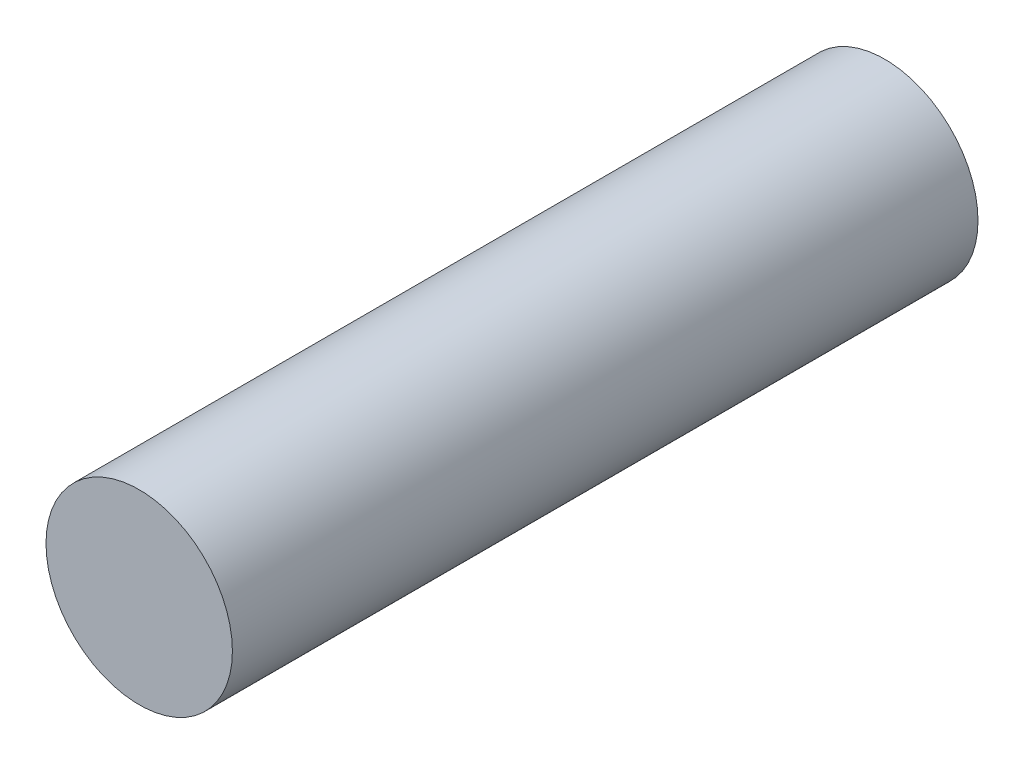
ISO-10303-21;
HEADER;
FILE_DESCRIPTION(('STEP AP214'),'2;1');
FILE_NAME('part.step','',(''),(''),'','','');
FILE_SCHEMA(('AUTOMOTIVE_DESIGN { 1 0 10303 214 1 1 1 1 }'));
ENDSEC;
DATA;
#1=APPLICATION_CONTEXT('core data for automotive mechanical design processes');
#2=APPLICATION_PROTOCOL_DEFINITION('international standard','automotive_design',2000,#1);
#3=PRODUCT_CONTEXT('',#1,'mechanical');
#4=PRODUCT('Part','Part','',(#3));
#5=PRODUCT_RELATED_PRODUCT_CATEGORY('part','',(#4));
#6=PRODUCT_DEFINITION_FORMATION('','',#4);
#7=PRODUCT_DEFINITION_CONTEXT('part definition',#1,'design');
#8=PRODUCT_DEFINITION('design','',#6,#7);
#9=PRODUCT_DEFINITION_SHAPE('','',#8);
#10=(LENGTH_UNIT() NAMED_UNIT(*) SI_UNIT(.MILLI.,.METRE.));
#11=(NAMED_UNIT(*) PLANE_ANGLE_UNIT() SI_UNIT($,.RADIAN.));
#12=(NAMED_UNIT(*) SI_UNIT($,.STERADIAN.) SOLID_ANGLE_UNIT());
#13=UNCERTAINTY_MEASURE_WITH_UNIT(LENGTH_MEASURE(1.E-05),#10,'distance_accuracy_value','');
#14=(GEOMETRIC_REPRESENTATION_CONTEXT(3) GLOBAL_UNCERTAINTY_ASSIGNED_CONTEXT((#13)) GLOBAL_UNIT_ASSIGNED_CONTEXT((#10,
#11,#12)) REPRESENTATION_CONTEXT('',''));
#15=CARTESIAN_POINT('',(0.,0.,0.));
#16=DIRECTION('',(0.,0.,1.));
#17=DIRECTION('',(1.,0.,0.));
#18=AXIS2_PLACEMENT_3D('',#15,#16,#17);
#19=CARTESIAN_POINT('',(0.,0.,84.));
#20=DIRECTION('',(0.,0.,-1.));
#21=DIRECTION('',(-1.,0.,0.));
#22=AXIS2_PLACEMENT_3D('',#19,#20,#21);
#23=CYLINDRICAL_SURFACE('',#22,10.5);
#24=CARTESIAN_POINT('',(0.,0.,84.));
#25=DIRECTION('',(0.,0.,1.));
#26=DIRECTION('',(1.,0.,0.));
#27=AXIS2_PLACEMENT_3D('',#24,#25,#26);
#28=CIRCLE('',#27,10.5);
#29=CARTESIAN_POINT('',(10.5,0.,84.));
#30=VERTEX_POINT('',#29);
#31=EDGE_CURVE('E10',#30,#30,#28,.T.);
#32=ORIENTED_EDGE('',*,*,#31,.F.);
#33=EDGE_LOOP('',(#32));
#34=FACE_BOUND('',#33,.T.);
#35=CARTESIAN_POINT('',(0.,0.,0.));
#36=DIRECTION('',(0.,0.,1.));
#37=DIRECTION('',(1.,0.,0.));
#38=AXIS2_PLACEMENT_3D('',#35,#36,#37);
#39=CIRCLE('',#38,10.5);
#40=CARTESIAN_POINT('',(10.5,0.,0.));
#41=VERTEX_POINT('',#40);
#42=EDGE_CURVE('E42',#41,#41,#39,.T.);
#43=ORIENTED_EDGE('',*,*,#42,.T.);
#44=EDGE_LOOP('',(#43));
#45=FACE_BOUND('',#44,.T.);
#46=ADVANCED_FACE('F39',(#34,#45),#23,.T.);
#47=CARTESIAN_POINT('',(0.,0.,84.));
#48=DIRECTION('',(0.,0.,1.));
#49=DIRECTION('',(1.,0.,0.));
#50=AXIS2_PLACEMENT_3D('',#47,#48,#49);
#51=PLANE('',#50);
#52=ORIENTED_EDGE('',*,*,#31,.T.);
#53=EDGE_LOOP('',(#52));
#54=FACE_BOUND('',#53,.T.);
#55=ADVANCED_FACE('F56',(#54),#51,.T.);
#56=CARTESIAN_POINT('',(0.,0.,0.));
#57=DIRECTION('',(0.,0.,1.));
#58=DIRECTION('',(1.,0.,0.));
#59=AXIS2_PLACEMENT_3D('',#56,#57,#58);
#60=PLANE('',#59);
#61=ORIENTED_EDGE('',*,*,#42,.F.);
#62=EDGE_LOOP('',(#61));
#63=FACE_BOUND('',#62,.T.);
#64=ADVANCED_FACE('F54',(#63),#60,.F.);
#65=CLOSED_SHELL('',(#46,#55,#64));
#66=MANIFOLD_SOLID_BREP('B2',#65);
#67=ADVANCED_BREP_SHAPE_REPRESENTATION('',(#18,#66),#14);
#68=SHAPE_DEFINITION_REPRESENTATION(#9,#67);
ENDSEC;
END-ISO-10303-21;
